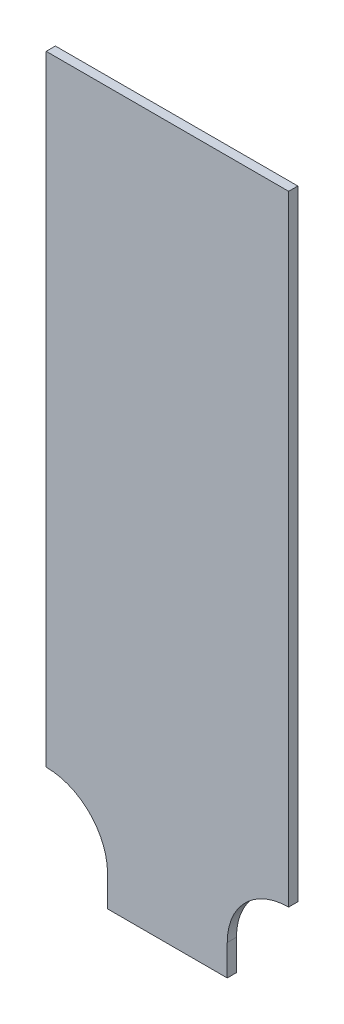
ISO-10303-21;
HEADER;
FILE_DESCRIPTION(('STEP AP214'),'2;1');
FILE_NAME('part.step','',(''),(''),'','','');
FILE_SCHEMA(('AUTOMOTIVE_DESIGN { 1 0 10303 214 1 1 1 1 }'));
ENDSEC;
DATA;
#1=APPLICATION_CONTEXT('core data for automotive mechanical design processes');
#2=APPLICATION_PROTOCOL_DEFINITION('international standard','automotive_design',2000,#1);
#3=PRODUCT_CONTEXT('',#1,'mechanical');
#4=PRODUCT('Part','Part','',(#3));
#5=PRODUCT_RELATED_PRODUCT_CATEGORY('part','',(#4));
#6=PRODUCT_DEFINITION_FORMATION('','',#4);
#7=PRODUCT_DEFINITION_CONTEXT('part definition',#1,'design');
#8=PRODUCT_DEFINITION('design','',#6,#7);
#9=PRODUCT_DEFINITION_SHAPE('','',#8);
#10=(LENGTH_UNIT() NAMED_UNIT(*) SI_UNIT(.MILLI.,.METRE.));
#11=(NAMED_UNIT(*) PLANE_ANGLE_UNIT() SI_UNIT($,.RADIAN.));
#12=(NAMED_UNIT(*) SI_UNIT($,.STERADIAN.) SOLID_ANGLE_UNIT());
#13=UNCERTAINTY_MEASURE_WITH_UNIT(LENGTH_MEASURE(1.E-05),#10,'distance_accuracy_value','');
#14=(GEOMETRIC_REPRESENTATION_CONTEXT(3) GLOBAL_UNCERTAINTY_ASSIGNED_CONTEXT((#13)) GLOBAL_UNIT_ASSIGNED_CONTEXT((#10,
#11,#12)) REPRESENTATION_CONTEXT('',''));
#15=CARTESIAN_POINT('',(0.,0.,0.));
#16=DIRECTION('',(0.,0.,1.));
#17=DIRECTION('',(1.,0.,0.));
#18=AXIS2_PLACEMENT_3D('',#15,#16,#17);
#19=CARTESIAN_POINT('',(-39.5,232.,3.));
#20=DIRECTION('',(1.,0.,0.));
#21=DIRECTION('',(0.,1.,0.));
#22=AXIS2_PLACEMENT_3D('',#19,#20,#21);
#23=PLANE('',#22);
#24=DIRECTION('',(0.,-1.,0.));
#25=VECTOR('',#24,1.);
#26=CARTESIAN_POINT('',(-39.5,232.,0.));
#27=LINE('',#26,#25);
#28=CARTESIAN_POINT('',(-39.5,232.,0.));
#29=VERTEX_POINT('',#28);
#30=CARTESIAN_POINT('',(-39.5,30.,0.));
#31=VERTEX_POINT('',#30);
#32=EDGE_CURVE('E126',#29,#31,#27,.T.);
#33=ORIENTED_EDGE('',*,*,#32,.T.);
#34=DIRECTION('',(0.,0.,-1.));
#35=VECTOR('',#34,1.);
#36=CARTESIAN_POINT('',(-39.5,30.,3.));
#37=LINE('',#36,#35);
#38=CARTESIAN_POINT('',(-39.5,30.,3.));
#39=VERTEX_POINT('',#38);
#40=EDGE_CURVE('E11',#39,#31,#37,.T.);
#41=ORIENTED_EDGE('',*,*,#40,.F.);
#42=DIRECTION('',(0.,-1.,0.));
#43=VECTOR('',#42,1.);
#44=CARTESIAN_POINT('',(-39.5,232.,3.));
#45=LINE('',#44,#43);
#46=CARTESIAN_POINT('',(-39.5,232.,3.));
#47=VERTEX_POINT('',#46);
#48=EDGE_CURVE('E140',#47,#39,#45,.T.);
#49=ORIENTED_EDGE('',*,*,#48,.F.);
#50=DIRECTION('',(0.,0.,-1.));
#51=VECTOR('',#50,1.);
#52=CARTESIAN_POINT('',(-39.5,232.,3.));
#53=LINE('',#52,#51);
#54=EDGE_CURVE('E122',#47,#29,#53,.T.);
#55=ORIENTED_EDGE('',*,*,#54,.T.);
#56=EDGE_LOOP('',(#33,#41,#49,#55));
#57=FACE_BOUND('',#56,.T.);
#58=ADVANCED_FACE('F30',(#57),#23,.F.);
#59=CARTESIAN_POINT('',(-39.5,9.99999999999999,3.));
#60=DIRECTION('',(0.,0.,-1.));
#61=DIRECTION('',(-1.,0.,0.));
#62=AXIS2_PLACEMENT_3D('',#59,#60,#61);
#63=CYLINDRICAL_SURFACE('',#62,20.);
#64=CARTESIAN_POINT('',(-39.5,9.99999999999999,0.));
#65=DIRECTION('',(0.,0.,-1.));
#66=DIRECTION('',(-1.,0.,0.));
#67=AXIS2_PLACEMENT_3D('',#64,#65,#66);
#68=CIRCLE('',#67,20.);
#69=CARTESIAN_POINT('',(-19.5,9.99999999999999,0.));
#70=VERTEX_POINT('',#69);
#71=EDGE_CURVE('E129',#31,#70,#68,.T.);
#72=ORIENTED_EDGE('',*,*,#71,.T.);
#73=DIRECTION('',(0.,0.,-1.));
#74=VECTOR('',#73,1.);
#75=CARTESIAN_POINT('',(-19.5,9.99999999999999,3.));
#76=LINE('',#75,#74);
#77=CARTESIAN_POINT('',(-19.5,9.99999999999999,3.));
#78=VERTEX_POINT('',#77);
#79=EDGE_CURVE('E38',#78,#70,#76,.T.);
#80=ORIENTED_EDGE('',*,*,#79,.F.);
#81=CARTESIAN_POINT('',(-39.5,9.99999999999999,3.));
#82=DIRECTION('',(0.,0.,-1.));
#83=DIRECTION('',(-1.,0.,0.));
#84=AXIS2_PLACEMENT_3D('',#81,#82,#83);
#85=CIRCLE('',#84,20.);
#86=EDGE_CURVE('E89',#39,#78,#85,.T.);
#87=ORIENTED_EDGE('',*,*,#86,.F.);
#88=ORIENTED_EDGE('',*,*,#40,.T.);
#89=EDGE_LOOP('',(#72,#80,#87,#88));
#90=FACE_BOUND('',#89,.T.);
#91=ADVANCED_FACE('F175',(#90),#63,.F.);
#92=CARTESIAN_POINT('',(-19.5,0.,3.));
#93=DIRECTION('',(1.,0.,0.));
#94=DIRECTION('',(0.,1.,0.));
#95=AXIS2_PLACEMENT_3D('',#92,#93,#94);
#96=PLANE('',#95);
#97=DIRECTION('',(0.,-1.,0.));
#98=VECTOR('',#97,1.);
#99=CARTESIAN_POINT('',(-19.5,0.,0.));
#100=LINE('',#99,#98);
#101=CARTESIAN_POINT('',(-19.5,0.,0.));
#102=VERTEX_POINT('',#101);
#103=EDGE_CURVE('E131',#70,#102,#100,.T.);
#104=ORIENTED_EDGE('',*,*,#103,.T.);
#105=DIRECTION('',(0.,0.,-1.));
#106=VECTOR('',#105,1.);
#107=CARTESIAN_POINT('',(-19.5,0.,3.));
#108=LINE('',#107,#106);
#109=CARTESIAN_POINT('',(-19.5,0.,3.));
#110=VERTEX_POINT('',#109);
#111=EDGE_CURVE('E147',#110,#102,#108,.T.);
#112=ORIENTED_EDGE('',*,*,#111,.F.);
#113=DIRECTION('',(0.,-1.,0.));
#114=VECTOR('',#113,1.);
#115=CARTESIAN_POINT('',(-19.5,0.,3.));
#116=LINE('',#115,#114);
#117=EDGE_CURVE('E155',#78,#110,#116,.T.);
#118=ORIENTED_EDGE('',*,*,#117,.F.);
#119=ORIENTED_EDGE('',*,*,#79,.T.);
#120=EDGE_LOOP('',(#104,#112,#118,#119));
#121=FACE_BOUND('',#120,.T.);
#122=ADVANCED_FACE('F153',(#121),#96,.F.);
#123=CARTESIAN_POINT('',(19.5,0.,3.));
#124=DIRECTION('',(0.,1.,0.));
#125=DIRECTION('',(0.,0.,1.));
#126=AXIS2_PLACEMENT_3D('',#123,#124,#125);
#127=PLANE('',#126);
#128=DIRECTION('',(1.,0.,0.));
#129=VECTOR('',#128,1.);
#130=CARTESIAN_POINT('',(19.5,0.,0.));
#131=LINE('',#130,#129);
#132=CARTESIAN_POINT('',(19.5,0.,0.));
#133=VERTEX_POINT('',#132);
#134=EDGE_CURVE('E133',#102,#133,#131,.T.);
#135=ORIENTED_EDGE('',*,*,#134,.T.);
#136=DIRECTION('',(0.,0.,-1.));
#137=VECTOR('',#136,1.);
#138=CARTESIAN_POINT('',(19.5,0.,3.));
#139=LINE('',#138,#137);
#140=CARTESIAN_POINT('',(19.5,0.,3.));
#141=VERTEX_POINT('',#140);
#142=EDGE_CURVE('E144',#141,#133,#139,.T.);
#143=ORIENTED_EDGE('',*,*,#142,.F.);
#144=DIRECTION('',(1.,0.,0.));
#145=VECTOR('',#144,1.);
#146=CARTESIAN_POINT('',(19.5,0.,3.));
#147=LINE('',#146,#145);
#148=EDGE_CURVE('E167',#110,#141,#147,.T.);
#149=ORIENTED_EDGE('',*,*,#148,.F.);
#150=ORIENTED_EDGE('',*,*,#111,.T.);
#151=EDGE_LOOP('',(#135,#143,#149,#150));
#152=FACE_BOUND('',#151,.T.);
#153=ADVANCED_FACE('F163',(#152),#127,.F.);
#154=CARTESIAN_POINT('',(19.5,0.,3.));
#155=DIRECTION('',(-1.,0.,0.));
#156=DIRECTION('',(0.,-1.,0.));
#157=AXIS2_PLACEMENT_3D('',#154,#155,#156);
#158=PLANE('',#157);
#159=DIRECTION('',(0.,1.,0.));
#160=VECTOR('',#159,1.);
#161=CARTESIAN_POINT('',(19.5,0.,0.));
#162=LINE('',#161,#160);
#163=CARTESIAN_POINT('',(19.5,9.99999999999999,0.));
#164=VERTEX_POINT('',#163);
#165=EDGE_CURVE('E135',#133,#164,#162,.T.);
#166=ORIENTED_EDGE('',*,*,#165,.T.);
#167=DIRECTION('',(0.,0.,-1.));
#168=VECTOR('',#167,1.);
#169=CARTESIAN_POINT('',(19.5,9.99999999999999,3.));
#170=LINE('',#169,#168);
#171=CARTESIAN_POINT('',(19.5,9.99999999999999,3.));
#172=VERTEX_POINT('',#171);
#173=EDGE_CURVE('E117',#172,#164,#170,.T.);
#174=ORIENTED_EDGE('',*,*,#173,.F.);
#175=DIRECTION('',(0.,1.,0.));
#176=VECTOR('',#175,1.);
#177=CARTESIAN_POINT('',(19.5,0.,3.));
#178=LINE('',#177,#176);
#179=EDGE_CURVE('E108',#141,#172,#178,.T.);
#180=ORIENTED_EDGE('',*,*,#179,.F.);
#181=ORIENTED_EDGE('',*,*,#142,.T.);
#182=EDGE_LOOP('',(#166,#174,#180,#181));
#183=FACE_BOUND('',#182,.T.);
#184=ADVANCED_FACE('F166',(#183),#158,.F.);
#185=CARTESIAN_POINT('',(39.5,9.99999999999999,3.));
#186=DIRECTION('',(0.,0.,-1.));
#187=DIRECTION('',(-1.,0.,0.));
#188=AXIS2_PLACEMENT_3D('',#185,#186,#187);
#189=CYLINDRICAL_SURFACE('',#188,20.);
#190=CARTESIAN_POINT('',(39.5,9.99999999999999,0.));
#191=DIRECTION('',(0.,0.,-1.));
#192=DIRECTION('',(1.,0.,0.));
#193=AXIS2_PLACEMENT_3D('',#190,#191,#192);
#194=CIRCLE('',#193,20.);
#195=CARTESIAN_POINT('',(39.5,30.,0.));
#196=VERTEX_POINT('',#195);
#197=EDGE_CURVE('E116',#164,#196,#194,.T.);
#198=ORIENTED_EDGE('',*,*,#197,.T.);
#199=DIRECTION('',(0.,0.,-1.));
#200=VECTOR('',#199,1.);
#201=CARTESIAN_POINT('',(39.5,30.,3.));
#202=LINE('',#201,#200);
#203=CARTESIAN_POINT('',(39.5,30.,3.));
#204=VERTEX_POINT('',#203);
#205=EDGE_CURVE('E113',#204,#196,#202,.T.);
#206=ORIENTED_EDGE('',*,*,#205,.F.);
#207=CARTESIAN_POINT('',(39.5,9.99999999999999,3.));
#208=DIRECTION('',(0.,0.,-1.));
#209=DIRECTION('',(1.,0.,0.));
#210=AXIS2_PLACEMENT_3D('',#207,#208,#209);
#211=CIRCLE('',#210,20.);
#212=EDGE_CURVE('E102',#172,#204,#211,.T.);
#213=ORIENTED_EDGE('',*,*,#212,.F.);
#214=ORIENTED_EDGE('',*,*,#173,.T.);
#215=EDGE_LOOP('',(#198,#206,#213,#214));
#216=FACE_BOUND('',#215,.T.);
#217=ADVANCED_FACE('F114',(#216),#189,.F.);
#218=CARTESIAN_POINT('',(39.5,232.,3.));
#219=DIRECTION('',(-1.,0.,0.));
#220=DIRECTION('',(0.,-1.,0.));
#221=AXIS2_PLACEMENT_3D('',#218,#219,#220);
#222=PLANE('',#221);
#223=DIRECTION('',(0.,1.,0.));
#224=VECTOR('',#223,1.);
#225=CARTESIAN_POINT('',(39.5,232.,0.));
#226=LINE('',#225,#224);
#227=CARTESIAN_POINT('',(39.5,232.,0.));
#228=VERTEX_POINT('',#227);
#229=EDGE_CURVE('E75',#196,#228,#226,.T.);
#230=ORIENTED_EDGE('',*,*,#229,.T.);
#231=DIRECTION('',(0.,0.,-1.));
#232=VECTOR('',#231,1.);
#233=CARTESIAN_POINT('',(39.5,232.,3.));
#234=LINE('',#233,#232);
#235=CARTESIAN_POINT('',(39.5,232.,3.));
#236=VERTEX_POINT('',#235);
#237=EDGE_CURVE('E118',#236,#228,#234,.T.);
#238=ORIENTED_EDGE('',*,*,#237,.F.);
#239=DIRECTION('',(0.,1.,0.));
#240=VECTOR('',#239,1.);
#241=CARTESIAN_POINT('',(39.5,232.,3.));
#242=LINE('',#241,#240);
#243=EDGE_CURVE('E106',#204,#236,#242,.T.);
#244=ORIENTED_EDGE('',*,*,#243,.F.);
#245=ORIENTED_EDGE('',*,*,#205,.T.);
#246=EDGE_LOOP('',(#230,#238,#244,#245));
#247=FACE_BOUND('',#246,.T.);
#248=ADVANCED_FACE('F120',(#247),#222,.F.);
#249=CARTESIAN_POINT('',(39.5,232.,3.));
#250=DIRECTION('',(0.,-1.,0.));
#251=DIRECTION('',(0.,0.,-1.));
#252=AXIS2_PLACEMENT_3D('',#249,#250,#251);
#253=PLANE('',#252);
#254=DIRECTION('',(-1.,0.,0.));
#255=VECTOR('',#254,1.);
#256=CARTESIAN_POINT('',(39.5,232.,0.));
#257=LINE('',#256,#255);
#258=EDGE_CURVE('E81',#228,#29,#257,.T.);
#259=ORIENTED_EDGE('',*,*,#258,.T.);
#260=ORIENTED_EDGE('',*,*,#54,.F.);
#261=DIRECTION('',(-1.,0.,0.));
#262=VECTOR('',#261,1.);
#263=CARTESIAN_POINT('',(39.5,232.,3.));
#264=LINE('',#263,#262);
#265=EDGE_CURVE('E46',#236,#47,#264,.T.);
#266=ORIENTED_EDGE('',*,*,#265,.F.);
#267=ORIENTED_EDGE('',*,*,#237,.T.);
#268=EDGE_LOOP('',(#259,#260,#266,#267));
#269=FACE_BOUND('',#268,.T.);
#270=ADVANCED_FACE('F191',(#269),#253,.F.);
#271=CARTESIAN_POINT('',(-39.5,9.99999999999999,3.));
#272=DIRECTION('',(0.,0.,-1.));
#273=DIRECTION('',(-1.,0.,0.));
#274=AXIS2_PLACEMENT_3D('',#271,#272,#273);
#275=PLANE('',#274);
#276=ORIENTED_EDGE('',*,*,#48,.T.);
#277=ORIENTED_EDGE('',*,*,#86,.T.);
#278=ORIENTED_EDGE('',*,*,#117,.T.);
#279=ORIENTED_EDGE('',*,*,#148,.T.);
#280=ORIENTED_EDGE('',*,*,#179,.T.);
#281=ORIENTED_EDGE('',*,*,#212,.T.);
#282=ORIENTED_EDGE('',*,*,#243,.T.);
#283=ORIENTED_EDGE('',*,*,#265,.T.);
#284=EDGE_LOOP('',(#276,#277,#278,#279,#280,#281,#282,#283));
#285=FACE_BOUND('',#284,.T.);
#286=ADVANCED_FACE('F104',(#285),#275,.F.);
#287=CARTESIAN_POINT('',(-39.5,9.99999999999999,0.));
#288=DIRECTION('',(0.,0.,-1.));
#289=DIRECTION('',(-1.,0.,0.));
#290=AXIS2_PLACEMENT_3D('',#287,#288,#289);
#291=PLANE('',#290);
#292=ORIENTED_EDGE('',*,*,#32,.F.);
#293=ORIENTED_EDGE('',*,*,#258,.F.);
#294=ORIENTED_EDGE('',*,*,#229,.F.);
#295=ORIENTED_EDGE('',*,*,#197,.F.);
#296=ORIENTED_EDGE('',*,*,#165,.F.);
#297=ORIENTED_EDGE('',*,*,#134,.F.);
#298=ORIENTED_EDGE('',*,*,#103,.F.);
#299=ORIENTED_EDGE('',*,*,#71,.F.);
#300=EDGE_LOOP('',(#292,#293,#294,#295,#296,#297,#298,#299));
#301=FACE_BOUND('',#300,.T.);
#302=ADVANCED_FACE('F159',(#301),#291,.T.);
#303=CLOSED_SHELL('',(#58,#91,#122,#153,#184,#217,#248,#270,#286,#302));
#304=MANIFOLD_SOLID_BREP('B2',#303);
#305=ADVANCED_BREP_SHAPE_REPRESENTATION('',(#18,#304),#14);
#306=SHAPE_DEFINITION_REPRESENTATION(#9,#305);
ENDSEC;
END-ISO-10303-21;
